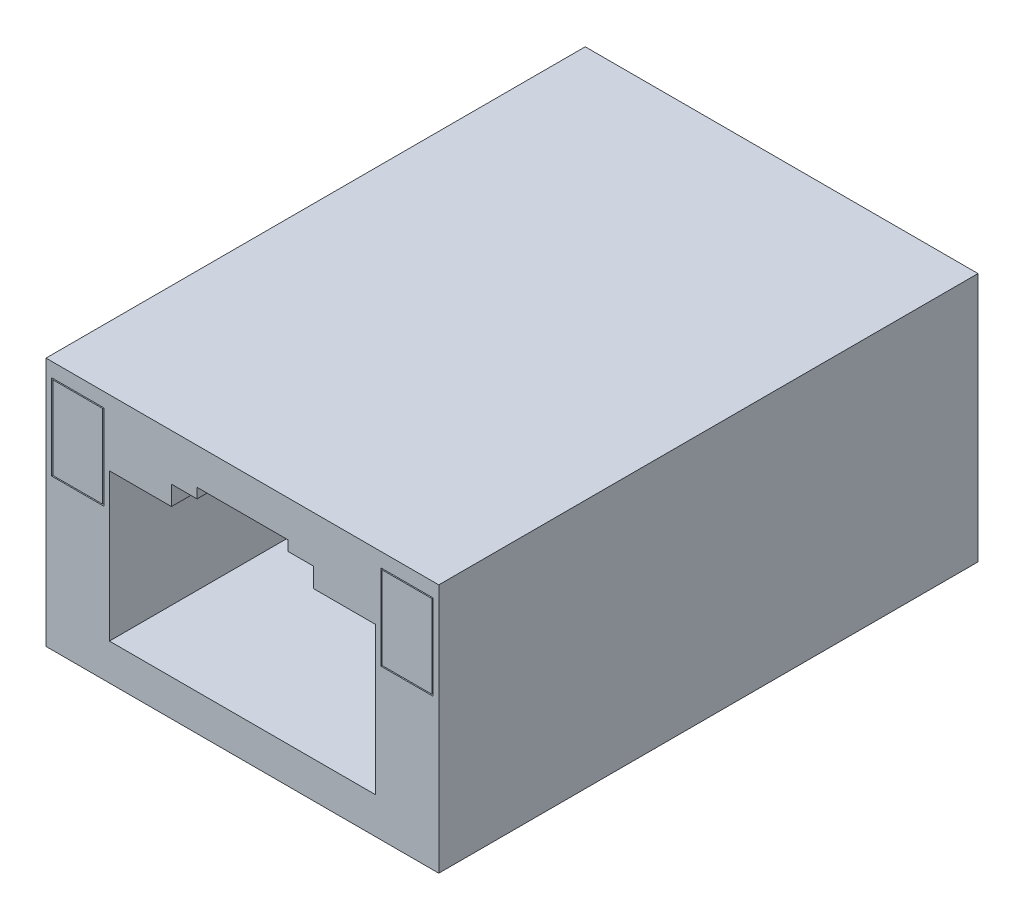
ISO-10303-21;
HEADER;
FILE_DESCRIPTION(('STEP AP214'),'2;1');
FILE_NAME('part.step','',(''),(''),'','','');
FILE_SCHEMA(('AUTOMOTIVE_DESIGN { 1 0 10303 214 1 1 1 1 }'));
ENDSEC;
DATA;
#1=APPLICATION_CONTEXT('core data for automotive mechanical design processes');
#2=APPLICATION_PROTOCOL_DEFINITION('international standard','automotive_design',2000,#1);
#3=PRODUCT_CONTEXT('',#1,'mechanical');
#4=PRODUCT('Part','Part','',(#3));
#5=PRODUCT_RELATED_PRODUCT_CATEGORY('part','',(#4));
#6=PRODUCT_DEFINITION_FORMATION('','',#4);
#7=PRODUCT_DEFINITION_CONTEXT('part definition',#1,'design');
#8=PRODUCT_DEFINITION('design','',#6,#7);
#9=PRODUCT_DEFINITION_SHAPE('','',#8);
#10=(LENGTH_UNIT() NAMED_UNIT(*) SI_UNIT(.MILLI.,.METRE.));
#11=(NAMED_UNIT(*) PLANE_ANGLE_UNIT() SI_UNIT($,.RADIAN.));
#12=(NAMED_UNIT(*) SI_UNIT($,.STERADIAN.) SOLID_ANGLE_UNIT());
#13=UNCERTAINTY_MEASURE_WITH_UNIT(LENGTH_MEASURE(1.E-05),#10,'distance_accuracy_value','');
#14=(GEOMETRIC_REPRESENTATION_CONTEXT(3) GLOBAL_UNCERTAINTY_ASSIGNED_CONTEXT((#13)) GLOBAL_UNIT_ASSIGNED_CONTEXT((#10,
#11,#12)) REPRESENTATION_CONTEXT('',''));
#15=CARTESIAN_POINT('',(0.,0.,0.));
#16=DIRECTION('',(0.,0.,1.));
#17=DIRECTION('',(1.,0.,0.));
#18=AXIS2_PLACEMENT_3D('',#15,#16,#17);
#19=CARTESIAN_POINT('',(0.,0.,-24.13));
#20=DIRECTION('',(-1.,0.,0.));
#21=DIRECTION('',(0.,0.,1.));
#22=AXIS2_PLACEMENT_3D('',#19,#20,#21);
#23=PLANE('',#22);
#24=DIRECTION('',(0.,-1.,0.));
#25=VECTOR('',#24,1.);
#26=CARTESIAN_POINT('',(0.,0.,0.));
#27=LINE('',#26,#25);
#28=CARTESIAN_POINT('',(0.,11.176,0.));
#29=VERTEX_POINT('',#28);
#30=CARTESIAN_POINT('',(0.,0.,0.));
#31=VERTEX_POINT('',#30);
#32=EDGE_CURVE('E453',#29,#31,#27,.T.);
#33=ORIENTED_EDGE('',*,*,#32,.F.);
#34=DIRECTION('',(0.,0.,1.));
#35=VECTOR('',#34,1.);
#36=CARTESIAN_POINT('',(0.,11.176,-24.13));
#37=LINE('',#36,#35);
#38=CARTESIAN_POINT('',(0.,11.176,-24.13));
#39=VERTEX_POINT('',#38);
#40=EDGE_CURVE('E11',#39,#29,#37,.T.);
#41=ORIENTED_EDGE('',*,*,#40,.F.);
#42=DIRECTION('',(0.,-1.,0.));
#43=VECTOR('',#42,1.);
#44=CARTESIAN_POINT('',(0.,0.,-24.13));
#45=LINE('',#44,#43);
#46=CARTESIAN_POINT('',(0.,0.,-24.13));
#47=VERTEX_POINT('',#46);
#48=EDGE_CURVE('E476',#39,#47,#45,.T.);
#49=ORIENTED_EDGE('',*,*,#48,.T.);
#50=DIRECTION('',(0.,0.,1.));
#51=VECTOR('',#50,1.);
#52=CARTESIAN_POINT('',(0.,0.,-24.13));
#53=LINE('',#52,#51);
#54=EDGE_CURVE('E37',#47,#31,#53,.T.);
#55=ORIENTED_EDGE('',*,*,#54,.T.);
#56=EDGE_LOOP('',(#33,#41,#49,#55));
#57=FACE_BOUND('',#56,.T.);
#58=ADVANCED_FACE('F34',(#57),#23,.T.);
#59=CARTESIAN_POINT('',(0.,11.176,-24.13));
#60=DIRECTION('',(0.,1.,0.));
#61=DIRECTION('',(0.,0.,1.));
#62=AXIS2_PLACEMENT_3D('',#59,#60,#61);
#63=PLANE('',#62);
#64=DIRECTION('',(-1.,0.,0.));
#65=VECTOR('',#64,1.);
#66=CARTESIAN_POINT('',(0.,11.176,0.));
#67=LINE('',#66,#65);
#68=CARTESIAN_POINT('',(17.5768,11.176,0.));
#69=VERTEX_POINT('',#68);
#70=EDGE_CURVE('E480',#69,#29,#67,.T.);
#71=ORIENTED_EDGE('',*,*,#70,.F.);
#72=DIRECTION('',(0.,0.,1.));
#73=VECTOR('',#72,1.);
#74=CARTESIAN_POINT('',(17.5768,11.176,-24.13));
#75=LINE('',#74,#73);
#76=CARTESIAN_POINT('',(17.5768,11.176,-24.13));
#77=VERTEX_POINT('',#76);
#78=EDGE_CURVE('E42',#77,#69,#75,.T.);
#79=ORIENTED_EDGE('',*,*,#78,.F.);
#80=DIRECTION('',(-1.,0.,0.));
#81=VECTOR('',#80,1.);
#82=CARTESIAN_POINT('',(0.,11.176,-24.13));
#83=LINE('',#82,#81);
#84=EDGE_CURVE('E486',#77,#39,#83,.T.);
#85=ORIENTED_EDGE('',*,*,#84,.T.);
#86=ORIENTED_EDGE('',*,*,#40,.T.);
#87=EDGE_LOOP('',(#71,#79,#85,#86));
#88=FACE_BOUND('',#87,.T.);
#89=ADVANCED_FACE('F512',(#88),#63,.T.);
#90=CARTESIAN_POINT('',(17.5768,0.,-24.13));
#91=DIRECTION('',(1.,0.,0.));
#92=DIRECTION('',(0.,0.,-1.));
#93=AXIS2_PLACEMENT_3D('',#90,#91,#92);
#94=PLANE('',#93);
#95=DIRECTION('',(0.,1.,0.));
#96=VECTOR('',#95,1.);
#97=CARTESIAN_POINT('',(17.5768,0.,0.));
#98=LINE('',#97,#96);
#99=CARTESIAN_POINT('',(17.5768,0.,0.));
#100=VERTEX_POINT('',#99);
#101=EDGE_CURVE('E494',#100,#69,#98,.T.);
#102=ORIENTED_EDGE('',*,*,#101,.F.);
#103=DIRECTION('',(0.,0.,1.));
#104=VECTOR('',#103,1.);
#105=CARTESIAN_POINT('',(17.5768,0.,-24.13));
#106=LINE('',#105,#104);
#107=CARTESIAN_POINT('',(17.5768,0.,-24.13));
#108=VERTEX_POINT('',#107);
#109=EDGE_CURVE('E499',#108,#100,#106,.T.);
#110=ORIENTED_EDGE('',*,*,#109,.F.);
#111=DIRECTION('',(0.,1.,0.));
#112=VECTOR('',#111,1.);
#113=CARTESIAN_POINT('',(17.5768,0.,-24.13));
#114=LINE('',#113,#112);
#115=EDGE_CURVE('E483',#108,#77,#114,.T.);
#116=ORIENTED_EDGE('',*,*,#115,.T.);
#117=ORIENTED_EDGE('',*,*,#78,.T.);
#118=EDGE_LOOP('',(#102,#110,#116,#117));
#119=FACE_BOUND('',#118,.T.);
#120=ADVANCED_FACE('F518',(#119),#94,.T.);
#121=CARTESIAN_POINT('',(0.,0.,-24.13));
#122=DIRECTION('',(0.,-1.,0.));
#123=DIRECTION('',(0.,0.,-1.));
#124=AXIS2_PLACEMENT_3D('',#121,#122,#123);
#125=PLANE('',#124);
#126=DIRECTION('',(1.,0.,0.));
#127=VECTOR('',#126,1.);
#128=CARTESIAN_POINT('',(0.,0.,0.));
#129=LINE('',#128,#127);
#130=EDGE_CURVE('E491',#31,#100,#129,.T.);
#131=ORIENTED_EDGE('',*,*,#130,.F.);
#132=ORIENTED_EDGE('',*,*,#54,.F.);
#133=DIRECTION('',(1.,0.,0.));
#134=VECTOR('',#133,1.);
#135=CARTESIAN_POINT('',(0.,0.,-24.13));
#136=LINE('',#135,#134);
#137=EDGE_CURVE('E479',#47,#108,#136,.T.);
#138=ORIENTED_EDGE('',*,*,#137,.T.);
#139=ORIENTED_EDGE('',*,*,#109,.T.);
#140=EDGE_LOOP('',(#131,#132,#138,#139));
#141=FACE_BOUND('',#140,.T.);
#142=ADVANCED_FACE('F507',(#141),#125,.T.);
#143=CARTESIAN_POINT('',(0.,0.,-24.13));
#144=DIRECTION('',(0.,0.,-1.));
#145=DIRECTION('',(-1.,0.,0.));
#146=AXIS2_PLACEMENT_3D('',#143,#144,#145);
#147=PLANE('',#146);
#148=ORIENTED_EDGE('',*,*,#48,.F.);
#149=ORIENTED_EDGE('',*,*,#84,.F.);
#150=ORIENTED_EDGE('',*,*,#115,.F.);
#151=ORIENTED_EDGE('',*,*,#137,.F.);
#152=EDGE_LOOP('',(#148,#149,#150,#151));
#153=FACE_BOUND('',#152,.T.);
#154=ADVANCED_FACE('F515',(#153),#147,.T.);
#155=CARTESIAN_POINT('',(0.,0.,0.));
#156=DIRECTION('',(0.,0.,-1.));
#157=DIRECTION('',(-1.,0.,0.));
#158=AXIS2_PLACEMENT_3D('',#155,#156,#157);
#159=PLANE('',#158);
#160=DIRECTION('',(1.,0.,0.));
#161=VECTOR('',#160,1.);
#162=CARTESIAN_POINT('',(14.9924,6.731,0.));
#163=LINE('',#162,#161);
#164=CARTESIAN_POINT('',(14.9924,6.731,0.));
#165=VERTEX_POINT('',#164);
#166=CARTESIAN_POINT('',(17.3228,6.731,0.));
#167=VERTEX_POINT('',#166);
#168=EDGE_CURVE('E299',#165,#167,#163,.T.);
#169=ORIENTED_EDGE('',*,*,#168,.F.);
#170=DIRECTION('',(0.,-1.,0.));
#171=VECTOR('',#170,1.);
#172=CARTESIAN_POINT('',(14.9924,10.541,0.));
#173=LINE('',#172,#171);
#174=CARTESIAN_POINT('',(14.9924,10.541,0.));
#175=VERTEX_POINT('',#174);
#176=EDGE_CURVE('E50',#175,#165,#173,.T.);
#177=ORIENTED_EDGE('',*,*,#176,.F.);
#178=DIRECTION('',(-1.,0.,0.));
#179=VECTOR('',#178,1.);
#180=CARTESIAN_POINT('',(14.9924,10.541,0.));
#181=LINE('',#180,#179);
#182=CARTESIAN_POINT('',(17.3228,10.541,0.));
#183=VERTEX_POINT('',#182);
#184=EDGE_CURVE('E288',#183,#175,#181,.T.);
#185=ORIENTED_EDGE('',*,*,#184,.F.);
#186=DIRECTION('',(0.,1.,0.));
#187=VECTOR('',#186,1.);
#188=CARTESIAN_POINT('',(17.3228,10.541,0.));
#189=LINE('',#188,#187);
#190=EDGE_CURVE('E302',#167,#183,#189,.T.);
#191=ORIENTED_EDGE('',*,*,#190,.F.);
#192=EDGE_LOOP('',(#169,#177,#185,#191));
#193=FACE_BOUND('',#192,.T.);
#194=DIRECTION('',(1.,0.,0.));
#195=VECTOR('',#194,1.);
#196=CARTESIAN_POINT('',(0.254000000000001,6.731,0.));
#197=LINE('',#196,#195);
#198=CARTESIAN_POINT('',(0.254000000000001,6.731,0.));
#199=VERTEX_POINT('',#198);
#200=CARTESIAN_POINT('',(2.5844,6.731,0.));
#201=VERTEX_POINT('',#200);
#202=EDGE_CURVE('E363',#199,#201,#197,.T.);
#203=ORIENTED_EDGE('',*,*,#202,.F.);
#204=DIRECTION('',(0.,-1.,0.));
#205=VECTOR('',#204,1.);
#206=CARTESIAN_POINT('',(0.254,10.541,0.));
#207=LINE('',#206,#205);
#208=CARTESIAN_POINT('',(0.254,10.541,0.));
#209=VERTEX_POINT('',#208);
#210=EDGE_CURVE('E341',#209,#199,#207,.T.);
#211=ORIENTED_EDGE('',*,*,#210,.F.);
#212=DIRECTION('',(-1.,0.,0.));
#213=VECTOR('',#212,1.);
#214=CARTESIAN_POINT('',(0.254,10.541,0.));
#215=LINE('',#214,#213);
#216=CARTESIAN_POINT('',(2.5844,10.541,0.));
#217=VERTEX_POINT('',#216);
#218=EDGE_CURVE('E352',#217,#209,#215,.T.);
#219=ORIENTED_EDGE('',*,*,#218,.F.);
#220=DIRECTION('',(0.,1.,0.));
#221=VECTOR('',#220,1.);
#222=CARTESIAN_POINT('',(2.5844,10.541,0.));
#223=LINE('',#222,#221);
#224=EDGE_CURVE('E366',#201,#217,#223,.T.);
#225=ORIENTED_EDGE('',*,*,#224,.F.);
#226=EDGE_LOOP('',(#203,#211,#219,#225));
#227=FACE_BOUND('',#226,.T.);
#228=DIRECTION('',(1.,0.,0.));
#229=VECTOR('',#228,1.);
#230=CARTESIAN_POINT('',(2.8384,1.628,0.));
#231=LINE('',#230,#229);
#232=CARTESIAN_POINT('',(2.8384,1.628,0.));
#233=VERTEX_POINT('',#232);
#234=CARTESIAN_POINT('',(14.7384,1.628,0.));
#235=VERTEX_POINT('',#234);
#236=EDGE_CURVE('E419',#233,#235,#231,.T.);
#237=ORIENTED_EDGE('',*,*,#236,.F.);
#238=DIRECTION('',(0.,-1.,0.));
#239=VECTOR('',#238,1.);
#240=CARTESIAN_POINT('',(2.8384,8.228,0.));
#241=LINE('',#240,#239);
#242=CARTESIAN_POINT('',(2.8384,8.228,0.));
#243=VERTEX_POINT('',#242);
#244=EDGE_CURVE('E373',#243,#233,#241,.T.);
#245=ORIENTED_EDGE('',*,*,#244,.F.);
#246=DIRECTION('',(-1.,0.,0.));
#247=VECTOR('',#246,1.);
#248=CARTESIAN_POINT('',(5.6134,8.228,0.));
#249=LINE('',#248,#247);
#250=CARTESIAN_POINT('',(5.6134,8.228,0.));
#251=VERTEX_POINT('',#250);
#252=EDGE_CURVE('E384',#251,#243,#249,.T.);
#253=ORIENTED_EDGE('',*,*,#252,.F.);
#254=DIRECTION('',(0.,-1.,0.));
#255=VECTOR('',#254,1.);
#256=CARTESIAN_POINT('',(5.6134,9.098,0.));
#257=LINE('',#256,#255);
#258=CARTESIAN_POINT('',(5.6134,9.098,0.));
#259=VERTEX_POINT('',#258);
#260=EDGE_CURVE('E446',#259,#251,#257,.T.);
#261=ORIENTED_EDGE('',*,*,#260,.F.);
#262=DIRECTION('',(-1.,0.,0.));
#263=VECTOR('',#262,1.);
#264=CARTESIAN_POINT('',(6.7584,9.098,0.));
#265=LINE('',#264,#263);
#266=CARTESIAN_POINT('',(6.7584,9.098,0.));
#267=VERTEX_POINT('',#266);
#268=EDGE_CURVE('E443',#267,#259,#265,.T.);
#269=ORIENTED_EDGE('',*,*,#268,.F.);
#270=DIRECTION('',(0.,-1.,0.));
#271=VECTOR('',#270,1.);
#272=CARTESIAN_POINT('',(6.7584,9.098,0.));
#273=LINE('',#272,#271);
#274=CARTESIAN_POINT('',(6.7584,9.548,0.));
#275=VERTEX_POINT('',#274);
#276=EDGE_CURVE('E440',#275,#267,#273,.T.);
#277=ORIENTED_EDGE('',*,*,#276,.F.);
#278=DIRECTION('',(-1.,0.,0.));
#279=VECTOR('',#278,1.);
#280=CARTESIAN_POINT('',(6.7584,9.548,0.));
#281=LINE('',#280,#279);
#282=CARTESIAN_POINT('',(10.8184,9.548,0.));
#283=VERTEX_POINT('',#282);
#284=EDGE_CURVE('E437',#283,#275,#281,.T.);
#285=ORIENTED_EDGE('',*,*,#284,.F.);
#286=DIRECTION('',(0.,1.,0.));
#287=VECTOR('',#286,1.);
#288=CARTESIAN_POINT('',(10.8184,9.548,0.));
#289=LINE('',#288,#287);
#290=CARTESIAN_POINT('',(10.8184,9.098,0.));
#291=VERTEX_POINT('',#290);
#292=EDGE_CURVE('E434',#291,#283,#289,.T.);
#293=ORIENTED_EDGE('',*,*,#292,.F.);
#294=DIRECTION('',(-1.,0.,0.));
#295=VECTOR('',#294,1.);
#296=CARTESIAN_POINT('',(11.9634,9.098,0.));
#297=LINE('',#296,#295);
#298=CARTESIAN_POINT('',(11.9634,9.098,0.));
#299=VERTEX_POINT('',#298);
#300=EDGE_CURVE('E431',#299,#291,#297,.T.);
#301=ORIENTED_EDGE('',*,*,#300,.F.);
#302=DIRECTION('',(0.,1.,0.));
#303=VECTOR('',#302,1.);
#304=CARTESIAN_POINT('',(11.9634,8.228,0.));
#305=LINE('',#304,#303);
#306=CARTESIAN_POINT('',(11.9634,8.228,0.));
#307=VERTEX_POINT('',#306);
#308=EDGE_CURVE('E428',#307,#299,#305,.T.);
#309=ORIENTED_EDGE('',*,*,#308,.F.);
#310=DIRECTION('',(-1.,0.,0.));
#311=VECTOR('',#310,1.);
#312=CARTESIAN_POINT('',(14.7384,8.228,0.));
#313=LINE('',#312,#311);
#314=CARTESIAN_POINT('',(14.7384,8.228,0.));
#315=VERTEX_POINT('',#314);
#316=EDGE_CURVE('E425',#315,#307,#313,.T.);
#317=ORIENTED_EDGE('',*,*,#316,.F.);
#318=DIRECTION('',(0.,1.,0.));
#319=VECTOR('',#318,1.);
#320=CARTESIAN_POINT('',(14.7384,1.628,0.));
#321=LINE('',#320,#319);
#322=EDGE_CURVE('E422',#235,#315,#321,.T.);
#323=ORIENTED_EDGE('',*,*,#322,.F.);
#324=EDGE_LOOP('',(#237,#245,#253,#261,#269,#277,#285,#293,#301,#309,#317,#323));
#325=FACE_BOUND('',#324,.T.);
#326=ORIENTED_EDGE('',*,*,#32,.T.);
#327=ORIENTED_EDGE('',*,*,#130,.T.);
#328=ORIENTED_EDGE('',*,*,#101,.T.);
#329=ORIENTED_EDGE('',*,*,#70,.T.);
#330=EDGE_LOOP('',(#326,#327,#328,#329));
#331=FACE_BOUND('',#330,.T.);
#332=ADVANCED_FACE('F509',(#193,#227,#325,#331),#159,.F.);
#333=CARTESIAN_POINT('',(2.8384,8.228,-22.55));
#334=DIRECTION('',(-1.,0.,0.));
#335=DIRECTION('',(0.,-1.,0.));
#336=AXIS2_PLACEMENT_3D('',#333,#334,#335);
#337=PLANE('',#336);
#338=ORIENTED_EDGE('',*,*,#244,.T.);
#339=DIRECTION('',(0.,0.,1.));
#340=VECTOR('',#339,1.);
#341=CARTESIAN_POINT('',(2.8384,1.628,-22.55));
#342=LINE('',#341,#340);
#343=CARTESIAN_POINT('',(2.8384,1.628,-22.55));
#344=VERTEX_POINT('',#343);
#345=EDGE_CURVE('E417',#344,#233,#342,.T.);
#346=ORIENTED_EDGE('',*,*,#345,.F.);
#347=DIRECTION('',(0.,-1.,0.));
#348=VECTOR('',#347,1.);
#349=CARTESIAN_POINT('',(2.8384,8.228,-22.55));
#350=LINE('',#349,#348);
#351=CARTESIAN_POINT('',(2.8384,8.228,-22.55));
#352=VERTEX_POINT('',#351);
#353=EDGE_CURVE('E380',#352,#344,#350,.T.);
#354=ORIENTED_EDGE('',*,*,#353,.F.);
#355=DIRECTION('',(0.,0.,1.));
#356=VECTOR('',#355,1.);
#357=CARTESIAN_POINT('',(2.8384,8.228,-22.55));
#358=LINE('',#357,#356);
#359=EDGE_CURVE('E451',#352,#243,#358,.T.);
#360=ORIENTED_EDGE('',*,*,#359,.T.);
#361=EDGE_LOOP('',(#338,#346,#354,#360));
#362=FACE_BOUND('',#361,.T.);
#363=ADVANCED_FACE('F558',(#362),#337,.F.);
#364=CARTESIAN_POINT('',(5.6134,8.228,-22.55));
#365=DIRECTION('',(0.,1.,0.));
#366=DIRECTION('',(0.,0.,1.));
#367=AXIS2_PLACEMENT_3D('',#364,#365,#366);
#368=PLANE('',#367);
#369=ORIENTED_EDGE('',*,*,#252,.T.);
#370=ORIENTED_EDGE('',*,*,#359,.F.);
#371=DIRECTION('',(-1.,0.,0.));
#372=VECTOR('',#371,1.);
#373=CARTESIAN_POINT('',(5.6134,8.228,-22.55));
#374=LINE('',#373,#372);
#375=CARTESIAN_POINT('',(5.6134,8.228,-22.55));
#376=VERTEX_POINT('',#375);
#377=EDGE_CURVE('E414',#376,#352,#374,.T.);
#378=ORIENTED_EDGE('',*,*,#377,.F.);
#379=DIRECTION('',(0.,0.,1.));
#380=VECTOR('',#379,1.);
#381=CARTESIAN_POINT('',(5.6134,8.228,-22.55));
#382=LINE('',#381,#380);
#383=EDGE_CURVE('E454',#376,#251,#382,.T.);
#384=ORIENTED_EDGE('',*,*,#383,.T.);
#385=EDGE_LOOP('',(#369,#370,#378,#384));
#386=FACE_BOUND('',#385,.T.);
#387=ADVANCED_FACE('F563',(#386),#368,.F.);
#388=CARTESIAN_POINT('',(5.6134,9.098,-22.55));
#389=DIRECTION('',(-1.,0.,0.));
#390=DIRECTION('',(0.,0.,1.));
#391=AXIS2_PLACEMENT_3D('',#388,#389,#390);
#392=PLANE('',#391);
#393=ORIENTED_EDGE('',*,*,#260,.T.);
#394=ORIENTED_EDGE('',*,*,#383,.F.);
#395=DIRECTION('',(0.,-1.,0.));
#396=VECTOR('',#395,1.);
#397=CARTESIAN_POINT('',(5.6134,9.098,-22.55));
#398=LINE('',#397,#396);
#399=CARTESIAN_POINT('',(5.6134,9.098,-22.55));
#400=VERTEX_POINT('',#399);
#401=EDGE_CURVE('E411',#400,#376,#398,.T.);
#402=ORIENTED_EDGE('',*,*,#401,.F.);
#403=DIRECTION('',(0.,0.,1.));
#404=VECTOR('',#403,1.);
#405=CARTESIAN_POINT('',(5.6134,9.098,-22.55));
#406=LINE('',#405,#404);
#407=EDGE_CURVE('E456',#400,#259,#406,.T.);
#408=ORIENTED_EDGE('',*,*,#407,.T.);
#409=EDGE_LOOP('',(#393,#394,#402,#408));
#410=FACE_BOUND('',#409,.T.);
#411=ADVANCED_FACE('F573',(#410),#392,.F.);
#412=CARTESIAN_POINT('',(6.7584,9.098,-22.55));
#413=DIRECTION('',(0.,1.,0.));
#414=DIRECTION('',(0.,0.,1.));
#415=AXIS2_PLACEMENT_3D('',#412,#413,#414);
#416=PLANE('',#415);
#417=ORIENTED_EDGE('',*,*,#268,.T.);
#418=ORIENTED_EDGE('',*,*,#407,.F.);
#419=DIRECTION('',(-1.,0.,0.));
#420=VECTOR('',#419,1.);
#421=CARTESIAN_POINT('',(6.7584,9.098,-22.55));
#422=LINE('',#421,#420);
#423=CARTESIAN_POINT('',(6.7584,9.098,-22.55));
#424=VERTEX_POINT('',#423);
#425=EDGE_CURVE('E408',#424,#400,#422,.T.);
#426=ORIENTED_EDGE('',*,*,#425,.F.);
#427=DIRECTION('',(0.,0.,1.));
#428=VECTOR('',#427,1.);
#429=CARTESIAN_POINT('',(6.7584,9.098,-22.55));
#430=LINE('',#429,#428);
#431=EDGE_CURVE('E458',#424,#267,#430,.T.);
#432=ORIENTED_EDGE('',*,*,#431,.T.);
#433=EDGE_LOOP('',(#417,#418,#426,#432));
#434=FACE_BOUND('',#433,.T.);
#435=ADVANCED_FACE('F583',(#434),#416,.F.);
#436=CARTESIAN_POINT('',(6.7584,9.098,-22.55));
#437=DIRECTION('',(-1.,0.,0.));
#438=DIRECTION('',(0.,0.,1.));
#439=AXIS2_PLACEMENT_3D('',#436,#437,#438);
#440=PLANE('',#439);
#441=ORIENTED_EDGE('',*,*,#276,.T.);
#442=ORIENTED_EDGE('',*,*,#431,.F.);
#443=DIRECTION('',(0.,-1.,0.));
#444=VECTOR('',#443,1.);
#445=CARTESIAN_POINT('',(6.7584,9.098,-22.55));
#446=LINE('',#445,#444);
#447=CARTESIAN_POINT('',(6.7584,9.548,-22.55));
#448=VERTEX_POINT('',#447);
#449=EDGE_CURVE('E405',#448,#424,#446,.T.);
#450=ORIENTED_EDGE('',*,*,#449,.F.);
#451=DIRECTION('',(0.,0.,1.));
#452=VECTOR('',#451,1.);
#453=CARTESIAN_POINT('',(6.7584,9.548,-22.55));
#454=LINE('',#453,#452);
#455=EDGE_CURVE('E460',#448,#275,#454,.T.);
#456=ORIENTED_EDGE('',*,*,#455,.T.);
#457=EDGE_LOOP('',(#441,#442,#450,#456));
#458=FACE_BOUND('',#457,.T.);
#459=ADVANCED_FACE('F593',(#458),#440,.F.);
#460=CARTESIAN_POINT('',(6.7584,9.548,-22.55));
#461=DIRECTION('',(0.,1.,0.));
#462=DIRECTION('',(0.,0.,1.));
#463=AXIS2_PLACEMENT_3D('',#460,#461,#462);
#464=PLANE('',#463);
#465=ORIENTED_EDGE('',*,*,#284,.T.);
#466=ORIENTED_EDGE('',*,*,#455,.F.);
#467=DIRECTION('',(-1.,0.,0.));
#468=VECTOR('',#467,1.);
#469=CARTESIAN_POINT('',(6.7584,9.548,-22.55));
#470=LINE('',#469,#468);
#471=CARTESIAN_POINT('',(10.8184,9.548,-22.55));
#472=VERTEX_POINT('',#471);
#473=EDGE_CURVE('E402',#472,#448,#470,.T.);
#474=ORIENTED_EDGE('',*,*,#473,.F.);
#475=DIRECTION('',(0.,0.,1.));
#476=VECTOR('',#475,1.);
#477=CARTESIAN_POINT('',(10.8184,9.548,-22.55));
#478=LINE('',#477,#476);
#479=EDGE_CURVE('E462',#472,#283,#478,.T.);
#480=ORIENTED_EDGE('',*,*,#479,.T.);
#481=EDGE_LOOP('',(#465,#466,#474,#480));
#482=FACE_BOUND('',#481,.T.);
#483=ADVANCED_FACE('F603',(#482),#464,.F.);
#484=CARTESIAN_POINT('',(10.8184,9.548,-22.55));
#485=DIRECTION('',(1.,0.,0.));
#486=DIRECTION('',(0.,0.,-1.));
#487=AXIS2_PLACEMENT_3D('',#484,#485,#486);
#488=PLANE('',#487);
#489=ORIENTED_EDGE('',*,*,#292,.T.);
#490=ORIENTED_EDGE('',*,*,#479,.F.);
#491=DIRECTION('',(0.,1.,0.));
#492=VECTOR('',#491,1.);
#493=CARTESIAN_POINT('',(10.8184,9.548,-22.55));
#494=LINE('',#493,#492);
#495=CARTESIAN_POINT('',(10.8184,9.098,-22.55));
#496=VERTEX_POINT('',#495);
#497=EDGE_CURVE('E399',#496,#472,#494,.T.);
#498=ORIENTED_EDGE('',*,*,#497,.F.);
#499=DIRECTION('',(0.,0.,1.));
#500=VECTOR('',#499,1.);
#501=CARTESIAN_POINT('',(10.8184,9.098,-22.55));
#502=LINE('',#501,#500);
#503=EDGE_CURVE('E464',#496,#291,#502,.T.);
#504=ORIENTED_EDGE('',*,*,#503,.T.);
#505=EDGE_LOOP('',(#489,#490,#498,#504));
#506=FACE_BOUND('',#505,.T.);
#507=ADVANCED_FACE('F613',(#506),#488,.F.);
#508=CARTESIAN_POINT('',(11.9634,9.098,-22.55));
#509=DIRECTION('',(0.,1.,0.));
#510=DIRECTION('',(0.,0.,1.));
#511=AXIS2_PLACEMENT_3D('',#508,#509,#510);
#512=PLANE('',#511);
#513=ORIENTED_EDGE('',*,*,#300,.T.);
#514=ORIENTED_EDGE('',*,*,#503,.F.);
#515=DIRECTION('',(-1.,0.,0.));
#516=VECTOR('',#515,1.);
#517=CARTESIAN_POINT('',(11.9634,9.098,-22.55));
#518=LINE('',#517,#516);
#519=CARTESIAN_POINT('',(11.9634,9.098,-22.55));
#520=VERTEX_POINT('',#519);
#521=EDGE_CURVE('E396',#520,#496,#518,.T.);
#522=ORIENTED_EDGE('',*,*,#521,.F.);
#523=DIRECTION('',(0.,0.,1.));
#524=VECTOR('',#523,1.);
#525=CARTESIAN_POINT('',(11.9634,9.098,-22.55));
#526=LINE('',#525,#524);
#527=EDGE_CURVE('E466',#520,#299,#526,.T.);
#528=ORIENTED_EDGE('',*,*,#527,.T.);
#529=EDGE_LOOP('',(#513,#514,#522,#528));
#530=FACE_BOUND('',#529,.T.);
#531=ADVANCED_FACE('F623',(#530),#512,.F.);
#532=CARTESIAN_POINT('',(11.9634,8.228,-22.55));
#533=DIRECTION('',(1.,0.,0.));
#534=DIRECTION('',(0.,0.,-1.));
#535=AXIS2_PLACEMENT_3D('',#532,#533,#534);
#536=PLANE('',#535);
#537=ORIENTED_EDGE('',*,*,#308,.T.);
#538=ORIENTED_EDGE('',*,*,#527,.F.);
#539=DIRECTION('',(0.,1.,0.));
#540=VECTOR('',#539,1.);
#541=CARTESIAN_POINT('',(11.9634,8.228,-22.55));
#542=LINE('',#541,#540);
#543=CARTESIAN_POINT('',(11.9634,8.228,-22.55));
#544=VERTEX_POINT('',#543);
#545=EDGE_CURVE('E393',#544,#520,#542,.T.);
#546=ORIENTED_EDGE('',*,*,#545,.F.);
#547=DIRECTION('',(0.,0.,1.));
#548=VECTOR('',#547,1.);
#549=CARTESIAN_POINT('',(11.9634,8.228,-22.55));
#550=LINE('',#549,#548);
#551=EDGE_CURVE('E468',#544,#307,#550,.T.);
#552=ORIENTED_EDGE('',*,*,#551,.T.);
#553=EDGE_LOOP('',(#537,#538,#546,#552));
#554=FACE_BOUND('',#553,.T.);
#555=ADVANCED_FACE('F633',(#554),#536,.F.);
#556=CARTESIAN_POINT('',(14.7384,8.228,-22.55));
#557=DIRECTION('',(0.,1.,0.));
#558=DIRECTION('',(0.,0.,1.));
#559=AXIS2_PLACEMENT_3D('',#556,#557,#558);
#560=PLANE('',#559);
#561=ORIENTED_EDGE('',*,*,#316,.T.);
#562=ORIENTED_EDGE('',*,*,#551,.F.);
#563=DIRECTION('',(-1.,0.,0.));
#564=VECTOR('',#563,1.);
#565=CARTESIAN_POINT('',(14.7384,8.228,-22.55));
#566=LINE('',#565,#564);
#567=CARTESIAN_POINT('',(14.7384,8.228,-22.55));
#568=VERTEX_POINT('',#567);
#569=EDGE_CURVE('E390',#568,#544,#566,.T.);
#570=ORIENTED_EDGE('',*,*,#569,.F.);
#571=DIRECTION('',(0.,0.,1.));
#572=VECTOR('',#571,1.);
#573=CARTESIAN_POINT('',(14.7384,8.228,-22.55));
#574=LINE('',#573,#572);
#575=EDGE_CURVE('E470',#568,#315,#574,.T.);
#576=ORIENTED_EDGE('',*,*,#575,.T.);
#577=EDGE_LOOP('',(#561,#562,#570,#576));
#578=FACE_BOUND('',#577,.T.);
#579=ADVANCED_FACE('F643',(#578),#560,.F.);
#580=CARTESIAN_POINT('',(14.7384,1.628,-22.55));
#581=DIRECTION('',(1.,0.,0.));
#582=DIRECTION('',(0.,0.,-1.));
#583=AXIS2_PLACEMENT_3D('',#580,#581,#582);
#584=PLANE('',#583);
#585=ORIENTED_EDGE('',*,*,#322,.T.);
#586=ORIENTED_EDGE('',*,*,#575,.F.);
#587=DIRECTION('',(0.,1.,0.));
#588=VECTOR('',#587,1.);
#589=CARTESIAN_POINT('',(14.7384,1.628,-22.55));
#590=LINE('',#589,#588);
#591=CARTESIAN_POINT('',(14.7384,1.628,-22.55));
#592=VERTEX_POINT('',#591);
#593=EDGE_CURVE('E387',#592,#568,#590,.T.);
#594=ORIENTED_EDGE('',*,*,#593,.F.);
#595=DIRECTION('',(0.,0.,1.));
#596=VECTOR('',#595,1.);
#597=CARTESIAN_POINT('',(14.7384,1.628,-22.55));
#598=LINE('',#597,#596);
#599=EDGE_CURVE('E472',#592,#235,#598,.T.);
#600=ORIENTED_EDGE('',*,*,#599,.T.);
#601=EDGE_LOOP('',(#585,#586,#594,#600));
#602=FACE_BOUND('',#601,.T.);
#603=ADVANCED_FACE('F653',(#602),#584,.F.);
#604=CARTESIAN_POINT('',(2.8384,1.628,-22.55));
#605=DIRECTION('',(0.,-1.,0.));
#606=DIRECTION('',(0.,0.,-1.));
#607=AXIS2_PLACEMENT_3D('',#604,#605,#606);
#608=PLANE('',#607);
#609=ORIENTED_EDGE('',*,*,#236,.T.);
#610=ORIENTED_EDGE('',*,*,#599,.F.);
#611=DIRECTION('',(1.,0.,0.));
#612=VECTOR('',#611,1.);
#613=CARTESIAN_POINT('',(2.8384,1.628,-22.55));
#614=LINE('',#613,#612);
#615=EDGE_CURVE('E383',#344,#592,#614,.T.);
#616=ORIENTED_EDGE('',*,*,#615,.F.);
#617=ORIENTED_EDGE('',*,*,#345,.T.);
#618=EDGE_LOOP('',(#609,#610,#616,#617));
#619=FACE_BOUND('',#618,.T.);
#620=ADVANCED_FACE('F663',(#619),#608,.F.);
#621=CARTESIAN_POINT('',(0.,0.,-22.55));
#622=DIRECTION('',(0.,0.,1.));
#623=DIRECTION('',(1.,0.,0.));
#624=AXIS2_PLACEMENT_3D('',#621,#622,#623);
#625=PLANE('',#624);
#626=ORIENTED_EDGE('',*,*,#353,.T.);
#627=ORIENTED_EDGE('',*,*,#615,.T.);
#628=ORIENTED_EDGE('',*,*,#593,.T.);
#629=ORIENTED_EDGE('',*,*,#569,.T.);
#630=ORIENTED_EDGE('',*,*,#545,.T.);
#631=ORIENTED_EDGE('',*,*,#521,.T.);
#632=ORIENTED_EDGE('',*,*,#497,.T.);
#633=ORIENTED_EDGE('',*,*,#473,.T.);
#634=ORIENTED_EDGE('',*,*,#449,.T.);
#635=ORIENTED_EDGE('',*,*,#425,.T.);
#636=ORIENTED_EDGE('',*,*,#401,.T.);
#637=ORIENTED_EDGE('',*,*,#377,.T.);
#638=EDGE_LOOP('',(#626,#627,#628,#629,#630,#631,#632,#633,#634,#635,#636,#637));
#639=FACE_BOUND('',#638,.T.);
#640=ADVANCED_FACE('F673',(#639),#625,.T.);
#641=CARTESIAN_POINT('',(0.254,10.541,-0.254));
#642=DIRECTION('',(-1.,0.,0.));
#643=DIRECTION('',(0.,-1.,0.));
#644=AXIS2_PLACEMENT_3D('',#641,#642,#643);
#645=PLANE('',#644);
#646=ORIENTED_EDGE('',*,*,#210,.T.);
#647=DIRECTION('',(0.,0.,1.));
#648=VECTOR('',#647,1.);
#649=CARTESIAN_POINT('',(0.254000000000001,6.731,-0.254));
#650=LINE('',#649,#648);
#651=CARTESIAN_POINT('',(0.254000000000001,6.731,-0.254));
#652=VERTEX_POINT('',#651);
#653=EDGE_CURVE('E361',#652,#199,#650,.T.);
#654=ORIENTED_EDGE('',*,*,#653,.F.);
#655=DIRECTION('',(0.,-1.,0.));
#656=VECTOR('',#655,1.);
#657=CARTESIAN_POINT('',(0.254,10.541,-0.254));
#658=LINE('',#657,#656);
#659=CARTESIAN_POINT('',(0.254,10.541,-0.254));
#660=VERTEX_POINT('',#659);
#661=EDGE_CURVE('E348',#660,#652,#658,.T.);
#662=ORIENTED_EDGE('',*,*,#661,.F.);
#663=DIRECTION('',(0.,0.,1.));
#664=VECTOR('',#663,1.);
#665=CARTESIAN_POINT('',(0.254,10.541,-0.254));
#666=LINE('',#665,#664);
#667=EDGE_CURVE('E371',#660,#209,#666,.T.);
#668=ORIENTED_EDGE('',*,*,#667,.T.);
#669=EDGE_LOOP('',(#646,#654,#662,#668));
#670=FACE_BOUND('',#669,.T.);
#671=ADVANCED_FACE('F683',(#670),#645,.F.);
#672=CARTESIAN_POINT('',(0.254,10.541,-0.254));
#673=DIRECTION('',(0.,1.,0.));
#674=DIRECTION('',(0.,0.,1.));
#675=AXIS2_PLACEMENT_3D('',#672,#673,#674);
#676=PLANE('',#675);
#677=ORIENTED_EDGE('',*,*,#218,.T.);
#678=ORIENTED_EDGE('',*,*,#667,.F.);
#679=DIRECTION('',(-1.,0.,0.));
#680=VECTOR('',#679,1.);
#681=CARTESIAN_POINT('',(0.254,10.541,-0.254));
#682=LINE('',#681,#680);
#683=CARTESIAN_POINT('',(2.5844,10.541,-0.254));
#684=VERTEX_POINT('',#683);
#685=EDGE_CURVE('E358',#684,#660,#682,.T.);
#686=ORIENTED_EDGE('',*,*,#685,.F.);
#687=DIRECTION('',(0.,0.,1.));
#688=VECTOR('',#687,1.);
#689=CARTESIAN_POINT('',(2.5844,10.541,-0.254));
#690=LINE('',#689,#688);
#691=EDGE_CURVE('E374',#684,#217,#690,.T.);
#692=ORIENTED_EDGE('',*,*,#691,.T.);
#693=EDGE_LOOP('',(#677,#678,#686,#692));
#694=FACE_BOUND('',#693,.T.);
#695=ADVANCED_FACE('F705',(#694),#676,.F.);
#696=CARTESIAN_POINT('',(2.5844,10.541,-0.254));
#697=DIRECTION('',(1.,0.,0.));
#698=DIRECTION('',(0.,1.,0.));
#699=AXIS2_PLACEMENT_3D('',#696,#697,#698);
#700=PLANE('',#699);
#701=ORIENTED_EDGE('',*,*,#224,.T.);
#702=ORIENTED_EDGE('',*,*,#691,.F.);
#703=DIRECTION('',(0.,1.,0.));
#704=VECTOR('',#703,1.);
#705=CARTESIAN_POINT('',(2.5844,10.541,-0.254));
#706=LINE('',#705,#704);
#707=CARTESIAN_POINT('',(2.5844,6.731,-0.254));
#708=VERTEX_POINT('',#707);
#709=EDGE_CURVE('E355',#708,#684,#706,.T.);
#710=ORIENTED_EDGE('',*,*,#709,.F.);
#711=DIRECTION('',(0.,0.,1.));
#712=VECTOR('',#711,1.);
#713=CARTESIAN_POINT('',(2.5844,6.731,-0.254));
#714=LINE('',#713,#712);
#715=EDGE_CURVE('E376',#708,#201,#714,.T.);
#716=ORIENTED_EDGE('',*,*,#715,.T.);
#717=EDGE_LOOP('',(#701,#702,#710,#716));
#718=FACE_BOUND('',#717,.T.);
#719=ADVANCED_FACE('F716',(#718),#700,.F.);
#720=CARTESIAN_POINT('',(0.254000000000001,6.731,-0.254));
#721=DIRECTION('',(0.,-1.,0.));
#722=DIRECTION('',(0.,0.,-1.));
#723=AXIS2_PLACEMENT_3D('',#720,#721,#722);
#724=PLANE('',#723);
#725=ORIENTED_EDGE('',*,*,#202,.T.);
#726=ORIENTED_EDGE('',*,*,#715,.F.);
#727=DIRECTION('',(1.,0.,0.));
#728=VECTOR('',#727,1.);
#729=CARTESIAN_POINT('',(0.254000000000001,6.731,-0.254));
#730=LINE('',#729,#728);
#731=EDGE_CURVE('E351',#652,#708,#730,.T.);
#732=ORIENTED_EDGE('',*,*,#731,.F.);
#733=ORIENTED_EDGE('',*,*,#653,.T.);
#734=EDGE_LOOP('',(#725,#726,#732,#733));
#735=FACE_BOUND('',#734,.T.);
#736=ADVANCED_FACE('F726',(#735),#724,.F.);
#737=CARTESIAN_POINT('',(0.,0.,-0.254));
#738=DIRECTION('',(0.,0.,1.));
#739=DIRECTION('',(1.,0.,0.));
#740=AXIS2_PLACEMENT_3D('',#737,#738,#739);
#741=PLANE('',#740);
#742=DIRECTION('',(-1.,0.,0.));
#743=VECTOR('',#742,1.);
#744=CARTESIAN_POINT('',(0.3048,10.4902,-0.254));
#745=LINE('',#744,#743);
#746=CARTESIAN_POINT('',(2.5336,10.4902,-0.254));
#747=VERTEX_POINT('',#746);
#748=CARTESIAN_POINT('',(0.3048,10.4902,-0.254));
#749=VERTEX_POINT('',#748);
#750=EDGE_CURVE('E325',#747,#749,#745,.T.);
#751=ORIENTED_EDGE('',*,*,#750,.F.);
#752=DIRECTION('',(0.,1.,0.));
#753=VECTOR('',#752,1.);
#754=CARTESIAN_POINT('',(2.5336,10.4902,-0.254));
#755=LINE('',#754,#753);
#756=CARTESIAN_POINT('',(2.5336,6.7818,-0.254));
#757=VERTEX_POINT('',#756);
#758=EDGE_CURVE('E322',#757,#747,#755,.T.);
#759=ORIENTED_EDGE('',*,*,#758,.F.);
#760=DIRECTION('',(1.,0.,0.));
#761=VECTOR('',#760,1.);
#762=CARTESIAN_POINT('',(0.3048,6.7818,-0.254));
#763=LINE('',#762,#761);
#764=CARTESIAN_POINT('',(0.3048,6.7818,-0.254));
#765=VERTEX_POINT('',#764);
#766=EDGE_CURVE('E318',#765,#757,#763,.T.);
#767=ORIENTED_EDGE('',*,*,#766,.F.);
#768=DIRECTION('',(0.,-1.,0.));
#769=VECTOR('',#768,1.);
#770=CARTESIAN_POINT('',(0.3048,10.4902,-0.254));
#771=LINE('',#770,#769);
#772=EDGE_CURVE('E315',#749,#765,#771,.T.);
#773=ORIENTED_EDGE('',*,*,#772,.F.);
#774=EDGE_LOOP('',(#751,#759,#767,#773));
#775=FACE_BOUND('',#774,.T.);
#776=ORIENTED_EDGE('',*,*,#661,.T.);
#777=ORIENTED_EDGE('',*,*,#731,.T.);
#778=ORIENTED_EDGE('',*,*,#709,.T.);
#779=ORIENTED_EDGE('',*,*,#685,.T.);
#780=EDGE_LOOP('',(#776,#777,#778,#779));
#781=FACE_BOUND('',#780,.T.);
#782=ADVANCED_FACE('F736',(#775,#781),#741,.T.);
#783=CARTESIAN_POINT('',(0.3048,10.4902,-0.254));
#784=DIRECTION('',(-1.,0.,0.));
#785=DIRECTION('',(0.,-1.,0.));
#786=AXIS2_PLACEMENT_3D('',#783,#784,#785);
#787=PLANE('',#786);
#788=DIRECTION('',(0.,-1.,0.));
#789=VECTOR('',#788,1.);
#790=CARTESIAN_POINT('',(0.3048,10.4902,0.));
#791=LINE('',#790,#789);
#792=CARTESIAN_POINT('',(0.3048,10.4902,0.));
#793=VERTEX_POINT('',#792);
#794=CARTESIAN_POINT('',(0.3048,6.7818,0.));
#795=VERTEX_POINT('',#794);
#796=EDGE_CURVE('E309',#793,#795,#791,.T.);
#797=ORIENTED_EDGE('',*,*,#796,.F.);
#798=DIRECTION('',(0.,0.,1.));
#799=VECTOR('',#798,1.);
#800=CARTESIAN_POINT('',(0.3048,10.4902,-0.254));
#801=LINE('',#800,#799);
#802=EDGE_CURVE('E339',#749,#793,#801,.T.);
#803=ORIENTED_EDGE('',*,*,#802,.F.);
#804=ORIENTED_EDGE('',*,*,#772,.T.);
#805=DIRECTION('',(0.,0.,1.));
#806=VECTOR('',#805,1.);
#807=CARTESIAN_POINT('',(0.3048,6.7818,-0.254));
#808=LINE('',#807,#806);
#809=EDGE_CURVE('E328',#765,#795,#808,.T.);
#810=ORIENTED_EDGE('',*,*,#809,.T.);
#811=EDGE_LOOP('',(#797,#803,#804,#810));
#812=FACE_BOUND('',#811,.T.);
#813=ADVANCED_FACE('F747',(#812),#787,.T.);
#814=CARTESIAN_POINT('',(0.3048,10.4902,-0.254));
#815=DIRECTION('',(0.,1.,0.));
#816=DIRECTION('',(0.,0.,1.));
#817=AXIS2_PLACEMENT_3D('',#814,#815,#816);
#818=PLANE('',#817);
#819=DIRECTION('',(-1.,0.,0.));
#820=VECTOR('',#819,1.);
#821=CARTESIAN_POINT('',(0.3048,10.4902,0.));
#822=LINE('',#821,#820);
#823=CARTESIAN_POINT('',(2.5336,10.4902,0.));
#824=VERTEX_POINT('',#823);
#825=EDGE_CURVE('E319',#824,#793,#822,.T.);
#826=ORIENTED_EDGE('',*,*,#825,.F.);
#827=DIRECTION('',(0.,0.,1.));
#828=VECTOR('',#827,1.);
#829=CARTESIAN_POINT('',(2.5336,10.4902,-0.254));
#830=LINE('',#829,#828);
#831=EDGE_CURVE('E342',#747,#824,#830,.T.);
#832=ORIENTED_EDGE('',*,*,#831,.F.);
#833=ORIENTED_EDGE('',*,*,#750,.T.);
#834=ORIENTED_EDGE('',*,*,#802,.T.);
#835=EDGE_LOOP('',(#826,#832,#833,#834));
#836=FACE_BOUND('',#835,.T.);
#837=ADVANCED_FACE('F760',(#836),#818,.T.);
#838=CARTESIAN_POINT('',(2.5336,10.4902,-0.254));
#839=DIRECTION('',(1.,0.,0.));
#840=DIRECTION('',(0.,1.,0.));
#841=AXIS2_PLACEMENT_3D('',#838,#839,#840);
#842=PLANE('',#841);
#843=DIRECTION('',(0.,1.,0.));
#844=VECTOR('',#843,1.);
#845=CARTESIAN_POINT('',(2.5336,10.4902,0.));
#846=LINE('',#845,#844);
#847=CARTESIAN_POINT('',(2.5336,6.7818,0.));
#848=VERTEX_POINT('',#847);
#849=EDGE_CURVE('E334',#848,#824,#846,.T.);
#850=ORIENTED_EDGE('',*,*,#849,.F.);
#851=DIRECTION('',(0.,0.,1.));
#852=VECTOR('',#851,1.);
#853=CARTESIAN_POINT('',(2.5336,6.7818,-0.254));
#854=LINE('',#853,#852);
#855=EDGE_CURVE('E344',#757,#848,#854,.T.);
#856=ORIENTED_EDGE('',*,*,#855,.F.);
#857=ORIENTED_EDGE('',*,*,#758,.T.);
#858=ORIENTED_EDGE('',*,*,#831,.T.);
#859=EDGE_LOOP('',(#850,#856,#857,#858));
#860=FACE_BOUND('',#859,.T.);
#861=ADVANCED_FACE('F771',(#860),#842,.T.);
#862=CARTESIAN_POINT('',(0.3048,6.7818,-0.254));
#863=DIRECTION('',(0.,-1.,0.));
#864=DIRECTION('',(0.,0.,-1.));
#865=AXIS2_PLACEMENT_3D('',#862,#863,#864);
#866=PLANE('',#865);
#867=DIRECTION('',(1.,0.,0.));
#868=VECTOR('',#867,1.);
#869=CARTESIAN_POINT('',(0.3048,6.7818,0.));
#870=LINE('',#869,#868);
#871=EDGE_CURVE('E331',#795,#848,#870,.T.);
#872=ORIENTED_EDGE('',*,*,#871,.F.);
#873=ORIENTED_EDGE('',*,*,#809,.F.);
#874=ORIENTED_EDGE('',*,*,#766,.T.);
#875=ORIENTED_EDGE('',*,*,#855,.T.);
#876=EDGE_LOOP('',(#872,#873,#874,#875));
#877=FACE_BOUND('',#876,.T.);
#878=ADVANCED_FACE('F782',(#877),#866,.T.);
#879=ORIENTED_EDGE('',*,*,#796,.T.);
#880=ORIENTED_EDGE('',*,*,#871,.T.);
#881=ORIENTED_EDGE('',*,*,#849,.T.);
#882=ORIENTED_EDGE('',*,*,#825,.T.);
#883=EDGE_LOOP('',(#879,#880,#881,#882));
#884=FACE_BOUND('',#883,.T.);
#885=ADVANCED_FACE('F697',(#884),#159,.F.);
#886=CARTESIAN_POINT('',(14.9924,10.541,-0.254));
#887=DIRECTION('',(-1.,0.,0.));
#888=DIRECTION('',(0.,0.,1.));
#889=AXIS2_PLACEMENT_3D('',#886,#887,#888);
#890=PLANE('',#889);
#891=ORIENTED_EDGE('',*,*,#176,.T.);
#892=DIRECTION('',(0.,0.,1.));
#893=VECTOR('',#892,1.);
#894=CARTESIAN_POINT('',(14.9924,6.731,-0.254));
#895=LINE('',#894,#893);
#896=CARTESIAN_POINT('',(14.9924,6.731,-0.254));
#897=VERTEX_POINT('',#896);
#898=EDGE_CURVE('E297',#897,#165,#895,.T.);
#899=ORIENTED_EDGE('',*,*,#898,.F.);
#900=DIRECTION('',(0.,-1.,0.));
#901=VECTOR('',#900,1.);
#902=CARTESIAN_POINT('',(14.9924,10.541,-0.254));
#903=LINE('',#902,#901);
#904=CARTESIAN_POINT('',(14.9924,10.541,-0.254));
#905=VERTEX_POINT('',#904);
#906=EDGE_CURVE('E284',#905,#897,#903,.T.);
#907=ORIENTED_EDGE('',*,*,#906,.F.);
#908=DIRECTION('',(0.,0.,1.));
#909=VECTOR('',#908,1.);
#910=CARTESIAN_POINT('',(14.9924,10.541,-0.254));
#911=LINE('',#910,#909);
#912=EDGE_CURVE('E307',#905,#175,#911,.T.);
#913=ORIENTED_EDGE('',*,*,#912,.T.);
#914=EDGE_LOOP('',(#891,#899,#907,#913));
#915=FACE_BOUND('',#914,.T.);
#916=ADVANCED_FACE('F803',(#915),#890,.F.);
#917=CARTESIAN_POINT('',(14.9924,10.541,-0.254));
#918=DIRECTION('',(0.,1.,0.));
#919=DIRECTION('',(0.,0.,1.));
#920=AXIS2_PLACEMENT_3D('',#917,#918,#919);
#921=PLANE('',#920);
#922=ORIENTED_EDGE('',*,*,#184,.T.);
#923=ORIENTED_EDGE('',*,*,#912,.F.);
#924=DIRECTION('',(-1.,0.,0.));
#925=VECTOR('',#924,1.);
#926=CARTESIAN_POINT('',(14.9924,10.541,-0.254));
#927=LINE('',#926,#925);
#928=CARTESIAN_POINT('',(17.3228,10.541,-0.254));
#929=VERTEX_POINT('',#928);
#930=EDGE_CURVE('E294',#929,#905,#927,.T.);
#931=ORIENTED_EDGE('',*,*,#930,.F.);
#932=DIRECTION('',(0.,0.,1.));
#933=VECTOR('',#932,1.);
#934=CARTESIAN_POINT('',(17.3228,10.541,-0.254));
#935=LINE('',#934,#933);
#936=EDGE_CURVE('E310',#929,#183,#935,.T.);
#937=ORIENTED_EDGE('',*,*,#936,.T.);
#938=EDGE_LOOP('',(#922,#923,#931,#937));
#939=FACE_BOUND('',#938,.T.);
#940=ADVANCED_FACE('F811',(#939),#921,.F.);
#941=CARTESIAN_POINT('',(17.3228,10.541,-0.254));
#942=DIRECTION('',(1.,0.,0.));
#943=DIRECTION('',(0.,0.,-1.));
#944=AXIS2_PLACEMENT_3D('',#941,#942,#943);
#945=PLANE('',#944);
#946=ORIENTED_EDGE('',*,*,#190,.T.);
#947=ORIENTED_EDGE('',*,*,#936,.F.);
#948=DIRECTION('',(0.,1.,0.));
#949=VECTOR('',#948,1.);
#950=CARTESIAN_POINT('',(17.3228,10.541,-0.254));
#951=LINE('',#950,#949);
#952=CARTESIAN_POINT('',(17.3228,6.731,-0.254));
#953=VERTEX_POINT('',#952);
#954=EDGE_CURVE('E291',#953,#929,#951,.T.);
#955=ORIENTED_EDGE('',*,*,#954,.F.);
#956=DIRECTION('',(0.,0.,1.));
#957=VECTOR('',#956,1.);
#958=CARTESIAN_POINT('',(17.3228,6.731,-0.254));
#959=LINE('',#958,#957);
#960=EDGE_CURVE('E312',#953,#167,#959,.T.);
#961=ORIENTED_EDGE('',*,*,#960,.T.);
#962=EDGE_LOOP('',(#946,#947,#955,#961));
#963=FACE_BOUND('',#962,.T.);
#964=ADVANCED_FACE('F820',(#963),#945,.F.);
#965=CARTESIAN_POINT('',(14.9924,6.731,-0.254));
#966=DIRECTION('',(0.,-1.,0.));
#967=DIRECTION('',(0.,0.,-1.));
#968=AXIS2_PLACEMENT_3D('',#965,#966,#967);
#969=PLANE('',#968);
#970=ORIENTED_EDGE('',*,*,#168,.T.);
#971=ORIENTED_EDGE('',*,*,#960,.F.);
#972=DIRECTION('',(1.,0.,0.));
#973=VECTOR('',#972,1.);
#974=CARTESIAN_POINT('',(14.9924,6.731,-0.254));
#975=LINE('',#974,#973);
#976=EDGE_CURVE('E287',#897,#953,#975,.T.);
#977=ORIENTED_EDGE('',*,*,#976,.F.);
#978=ORIENTED_EDGE('',*,*,#898,.T.);
#979=EDGE_LOOP('',(#970,#971,#977,#978));
#980=FACE_BOUND('',#979,.T.);
#981=ADVANCED_FACE('F830',(#980),#969,.F.);
#982=CARTESIAN_POINT('',(0.,0.,-0.254));
#983=DIRECTION('',(0.,0.,1.));
#984=DIRECTION('',(1.,0.,0.));
#985=AXIS2_PLACEMENT_3D('',#982,#983,#984);
#986=PLANE('',#985);
#987=DIRECTION('',(-1.,0.,0.));
#988=VECTOR('',#987,1.);
#989=CARTESIAN_POINT('',(15.0432,10.4902,-0.254));
#990=LINE('',#989,#988);
#991=CARTESIAN_POINT('',(17.272,10.4902,-0.254));
#992=VERTEX_POINT('',#991);
#993=CARTESIAN_POINT('',(15.0432,10.4902,-0.254));
#994=VERTEX_POINT('',#993);
#995=EDGE_CURVE('E255',#992,#994,#990,.T.);
#996=ORIENTED_EDGE('',*,*,#995,.F.);
#997=DIRECTION('',(0.,1.,0.));
#998=VECTOR('',#997,1.);
#999=CARTESIAN_POINT('',(17.272,10.4902,-0.254));
#1000=LINE('',#999,#998);
#1001=CARTESIAN_POINT('',(17.272,6.7818,-0.254));
#1002=VERTEX_POINT('',#1001);
#1003=EDGE_CURVE('E265',#1002,#992,#1000,.T.);
#1004=ORIENTED_EDGE('',*,*,#1003,.F.);
#1005=DIRECTION('',(1.,0.,0.));
#1006=VECTOR('',#1005,1.);
#1007=CARTESIAN_POINT('',(15.0432,6.7818,-0.254));
#1008=LINE('',#1007,#1006);
#1009=CARTESIAN_POINT('',(15.0432,6.7818,-0.254));
#1010=VERTEX_POINT('',#1009);
#1011=EDGE_CURVE('E247',#1010,#1002,#1008,.T.);
#1012=ORIENTED_EDGE('',*,*,#1011,.F.);
#1013=DIRECTION('',(0.,-1.,0.));
#1014=VECTOR('',#1013,1.);
#1015=CARTESIAN_POINT('',(15.0432,10.4902,-0.254));
#1016=LINE('',#1015,#1014);
#1017=EDGE_CURVE('E262',#994,#1010,#1016,.T.);
#1018=ORIENTED_EDGE('',*,*,#1017,.F.);
#1019=EDGE_LOOP('',(#996,#1004,#1012,#1018));
#1020=FACE_BOUND('',#1019,.T.);
#1021=ORIENTED_EDGE('',*,*,#906,.T.);
#1022=ORIENTED_EDGE('',*,*,#976,.T.);
#1023=ORIENTED_EDGE('',*,*,#954,.T.);
#1024=ORIENTED_EDGE('',*,*,#930,.T.);
#1025=EDGE_LOOP('',(#1021,#1022,#1023,#1024));
#1026=FACE_BOUND('',#1025,.T.);
#1027=ADVANCED_FACE('F260',(#1020,#1026),#986,.T.);
#1028=CARTESIAN_POINT('',(15.0432,10.4902,-0.254));
#1029=DIRECTION('',(-1.,0.,0.));
#1030=DIRECTION('',(0.,0.,1.));
#1031=AXIS2_PLACEMENT_3D('',#1028,#1029,#1030);
#1032=PLANE('',#1031);
#1033=DIRECTION('',(0.,-1.,0.));
#1034=VECTOR('',#1033,1.);
#1035=CARTESIAN_POINT('',(15.0432,10.4902,0.));
#1036=LINE('',#1035,#1034);
#1037=CARTESIAN_POINT('',(15.0432,10.4902,0.));
#1038=VERTEX_POINT('',#1037);
#1039=CARTESIAN_POINT('',(15.0432,6.7818,0.));
#1040=VERTEX_POINT('',#1039);
#1041=EDGE_CURVE('E276',#1038,#1040,#1036,.T.);
#1042=ORIENTED_EDGE('',*,*,#1041,.F.);
#1043=DIRECTION('',(0.,0.,1.));
#1044=VECTOR('',#1043,1.);
#1045=CARTESIAN_POINT('',(15.0432,10.4902,-0.254));
#1046=LINE('',#1045,#1044);
#1047=EDGE_CURVE('E268',#994,#1038,#1046,.T.);
#1048=ORIENTED_EDGE('',*,*,#1047,.F.);
#1049=ORIENTED_EDGE('',*,*,#1017,.T.);
#1050=DIRECTION('',(0.,0.,1.));
#1051=VECTOR('',#1050,1.);
#1052=CARTESIAN_POINT('',(15.0432,6.7818,-0.254));
#1053=LINE('',#1052,#1051);
#1054=EDGE_CURVE('E244',#1010,#1040,#1053,.T.);
#1055=ORIENTED_EDGE('',*,*,#1054,.T.);
#1056=EDGE_LOOP('',(#1042,#1048,#1049,#1055));
#1057=FACE_BOUND('',#1056,.T.);
#1058=ADVANCED_FACE('F267',(#1057),#1032,.T.);
#1059=CARTESIAN_POINT('',(15.0432,10.4902,-0.254));
#1060=DIRECTION('',(0.,1.,0.));
#1061=DIRECTION('',(0.,0.,1.));
#1062=AXIS2_PLACEMENT_3D('',#1059,#1060,#1061);
#1063=PLANE('',#1062);
#1064=DIRECTION('',(-1.,0.,0.));
#1065=VECTOR('',#1064,1.);
#1066=CARTESIAN_POINT('',(15.0432,10.4902,0.));
#1067=LINE('',#1066,#1065);
#1068=CARTESIAN_POINT('',(17.272,10.4902,0.));
#1069=VERTEX_POINT('',#1068);
#1070=EDGE_CURVE('E269',#1069,#1038,#1067,.T.);
#1071=ORIENTED_EDGE('',*,*,#1070,.F.);
#1072=DIRECTION('',(0.,0.,1.));
#1073=VECTOR('',#1072,1.);
#1074=CARTESIAN_POINT('',(17.272,10.4902,-0.254));
#1075=LINE('',#1074,#1073);
#1076=EDGE_CURVE('E281',#992,#1069,#1075,.T.);
#1077=ORIENTED_EDGE('',*,*,#1076,.F.);
#1078=ORIENTED_EDGE('',*,*,#995,.T.);
#1079=ORIENTED_EDGE('',*,*,#1047,.T.);
#1080=EDGE_LOOP('',(#1071,#1077,#1078,#1079));
#1081=FACE_BOUND('',#1080,.T.);
#1082=ADVANCED_FACE('F858',(#1081),#1063,.T.);
#1083=CARTESIAN_POINT('',(17.272,10.4902,-0.254));
#1084=DIRECTION('',(1.,0.,0.));
#1085=DIRECTION('',(0.,0.,-1.));
#1086=AXIS2_PLACEMENT_3D('',#1083,#1084,#1085);
#1087=PLANE('',#1086);
#1088=DIRECTION('',(0.,1.,0.));
#1089=VECTOR('',#1088,1.);
#1090=CARTESIAN_POINT('',(17.272,10.4902,0.));
#1091=LINE('',#1090,#1089);
#1092=CARTESIAN_POINT('',(17.272,6.7818,0.));
#1093=VERTEX_POINT('',#1092);
#1094=EDGE_CURVE('E58',#1093,#1069,#1091,.T.);
#1095=ORIENTED_EDGE('',*,*,#1094,.F.);
#1096=DIRECTION('',(0.,0.,1.));
#1097=VECTOR('',#1096,1.);
#1098=CARTESIAN_POINT('',(17.272,6.7818,-0.254));
#1099=LINE('',#1098,#1097);
#1100=EDGE_CURVE('E254',#1002,#1093,#1099,.T.);
#1101=ORIENTED_EDGE('',*,*,#1100,.F.);
#1102=ORIENTED_EDGE('',*,*,#1003,.T.);
#1103=ORIENTED_EDGE('',*,*,#1076,.T.);
#1104=EDGE_LOOP('',(#1095,#1101,#1102,#1103));
#1105=FACE_BOUND('',#1104,.T.);
#1106=ADVANCED_FACE('F869',(#1105),#1087,.T.);
#1107=CARTESIAN_POINT('',(15.0432,6.7818,-0.254));
#1108=DIRECTION('',(0.,-1.,0.));
#1109=DIRECTION('',(0.,0.,-1.));
#1110=AXIS2_PLACEMENT_3D('',#1107,#1108,#1109);
#1111=PLANE('',#1110);
#1112=DIRECTION('',(1.,0.,0.));
#1113=VECTOR('',#1112,1.);
#1114=CARTESIAN_POINT('',(15.0432,6.7818,0.));
#1115=LINE('',#1114,#1113);
#1116=EDGE_CURVE('E249',#1040,#1093,#1115,.T.);
#1117=ORIENTED_EDGE('',*,*,#1116,.F.);
#1118=ORIENTED_EDGE('',*,*,#1054,.F.);
#1119=ORIENTED_EDGE('',*,*,#1011,.T.);
#1120=ORIENTED_EDGE('',*,*,#1100,.T.);
#1121=EDGE_LOOP('',(#1117,#1118,#1119,#1120));
#1122=FACE_BOUND('',#1121,.T.);
#1123=ADVANCED_FACE('F246',(#1122),#1111,.T.);
#1124=ORIENTED_EDGE('',*,*,#1041,.T.);
#1125=ORIENTED_EDGE('',*,*,#1116,.T.);
#1126=ORIENTED_EDGE('',*,*,#1094,.T.);
#1127=ORIENTED_EDGE('',*,*,#1070,.T.);
#1128=EDGE_LOOP('',(#1124,#1125,#1126,#1127));
#1129=FACE_BOUND('',#1128,.T.);
#1130=ADVANCED_FACE('F696',(#1129),#159,.F.);
#1131=CLOSED_SHELL('',(#58,#89,#120,#142,#154,#332,#363,#387,#411,#435,#459,#483,#507,#531,#555,
#579,#603,#620,#640,#671,#695,#719,#736,#782,#813,#837,#861,#878,#885,#916,#940,#964,#981,#1027,
#1058,#1082,#1106,#1123,#1130));
#1132=MANIFOLD_SOLID_BREP('B2',#1131);
#1133=ADVANCED_BREP_SHAPE_REPRESENTATION('',(#18,#1132),#14);
#1134=SHAPE_DEFINITION_REPRESENTATION(#9,#1133);
ENDSEC;
END-ISO-10303-21;
